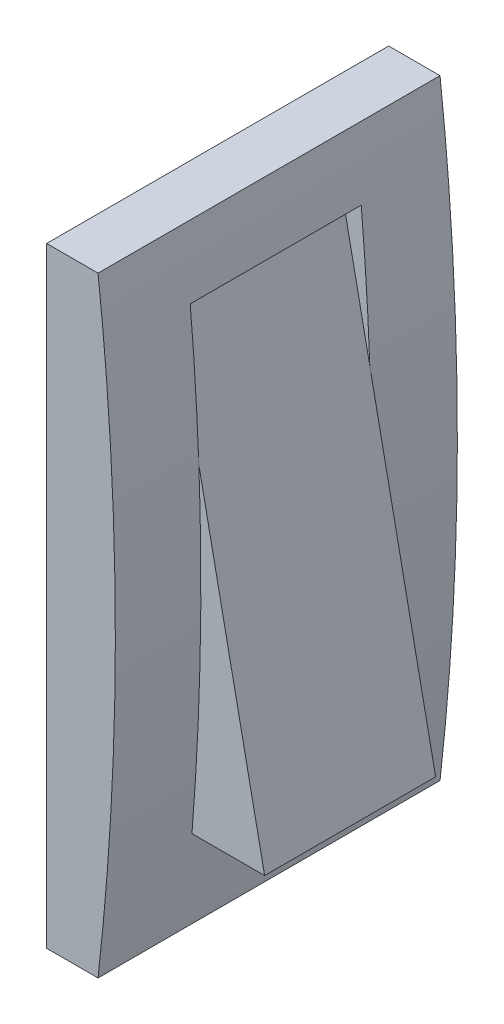
ISO-10303-21;
HEADER;
FILE_DESCRIPTION(('STEP AP214'),'2;1');
FILE_NAME('part.step','',(''),(''),'','','');
FILE_SCHEMA(('AUTOMOTIVE_DESIGN { 1 0 10303 214 1 1 1 1 }'));
ENDSEC;
DATA;
#1=APPLICATION_CONTEXT('core data for automotive mechanical design processes');
#2=APPLICATION_PROTOCOL_DEFINITION('international standard','automotive_design',2000,#1);
#3=PRODUCT_CONTEXT('',#1,'mechanical');
#4=PRODUCT('Part','Part','',(#3));
#5=PRODUCT_RELATED_PRODUCT_CATEGORY('part','',(#4));
#6=PRODUCT_DEFINITION_FORMATION('','',#4);
#7=PRODUCT_DEFINITION_CONTEXT('part definition',#1,'design');
#8=PRODUCT_DEFINITION('design','',#6,#7);
#9=PRODUCT_DEFINITION_SHAPE('','',#8);
#10=(LENGTH_UNIT() NAMED_UNIT(*) SI_UNIT(.MILLI.,.METRE.));
#11=(NAMED_UNIT(*) PLANE_ANGLE_UNIT() SI_UNIT($,.RADIAN.));
#12=(NAMED_UNIT(*) SI_UNIT($,.STERADIAN.) SOLID_ANGLE_UNIT());
#13=UNCERTAINTY_MEASURE_WITH_UNIT(LENGTH_MEASURE(1.E-05),#10,'distance_accuracy_value','');
#14=(GEOMETRIC_REPRESENTATION_CONTEXT(3) GLOBAL_UNCERTAINTY_ASSIGNED_CONTEXT((#13)) GLOBAL_UNIT_ASSIGNED_CONTEXT((#10,
#11,#12)) REPRESENTATION_CONTEXT('',''));
#15=CARTESIAN_POINT('',(0.,0.,0.));
#16=DIRECTION('',(0.,0.,1.));
#17=DIRECTION('',(1.,0.,0.));
#18=AXIS2_PLACEMENT_3D('',#15,#16,#17);
#19=CARTESIAN_POINT('',(0.,-35.6974549437155,-20.));
#20=DIRECTION('',(0.,-1.,0.));
#21=DIRECTION('',(0.,0.,-1.));
#22=AXIS2_PLACEMENT_3D('',#19,#20,#21);
#23=PLANE('',#22);
#24=DIRECTION('',(0.,0.,1.));
#25=VECTOR('',#24,1.);
#26=CARTESIAN_POINT('',(6.00944832763967,-35.6974549437155,-20.));
#27=LINE('',#26,#25);
#28=CARTESIAN_POINT('',(6.00944832763967,-35.6974549437155,-20.));
#29=VERTEX_POINT('',#28);
#30=CARTESIAN_POINT('',(6.00944832763967,-35.6974549437155,20.));
#31=VERTEX_POINT('',#30);
#32=EDGE_CURVE('E212',#29,#31,#27,.T.);
#33=ORIENTED_EDGE('',*,*,#32,.T.);
#34=DIRECTION('',(1.,0.,0.));
#35=VECTOR('',#34,1.);
#36=CARTESIAN_POINT('',(0.,-35.6974549437155,20.));
#37=LINE('',#36,#35);
#38=CARTESIAN_POINT('',(0.,-35.6974549437155,20.));
#39=VERTEX_POINT('',#38);
#40=EDGE_CURVE('E135',#39,#31,#37,.T.);
#41=ORIENTED_EDGE('',*,*,#40,.F.);
#42=DIRECTION('',(0.,0.,1.));
#43=VECTOR('',#42,1.);
#44=CARTESIAN_POINT('',(0.,-35.6974549437155,-20.));
#45=LINE('',#44,#43);
#46=CARTESIAN_POINT('',(0.,-35.6974549437155,-20.));
#47=VERTEX_POINT('',#46);
#48=EDGE_CURVE('E225',#47,#39,#45,.T.);
#49=ORIENTED_EDGE('',*,*,#48,.F.);
#50=DIRECTION('',(1.,0.,0.));
#51=VECTOR('',#50,1.);
#52=CARTESIAN_POINT('',(0.,-35.6974549437155,-20.));
#53=LINE('',#52,#51);
#54=EDGE_CURVE('E152',#47,#29,#53,.T.);
#55=ORIENTED_EDGE('',*,*,#54,.T.);
#56=EDGE_LOOP('',(#33,#41,#49,#55));
#57=FACE_BOUND('',#56,.T.);
#58=ADVANCED_FACE('F32',(#57),#23,.T.);
#59=CARTESIAN_POINT('',(0.,-35.6974549437155,-20.));
#60=DIRECTION('',(-1.,0.,0.));
#61=DIRECTION('',(0.,0.,1.));
#62=AXIS2_PLACEMENT_3D('',#59,#60,#61);
#63=PLANE('',#62);
#64=ORIENTED_EDGE('',*,*,#48,.T.);
#65=DIRECTION('',(0.,-1.,0.));
#66=VECTOR('',#65,1.);
#67=CARTESIAN_POINT('',(0.,-35.6974549437155,20.));
#68=LINE('',#67,#66);
#69=CARTESIAN_POINT('',(0.,35.6974549437155,20.));
#70=VERTEX_POINT('',#69);
#71=EDGE_CURVE('E149',#70,#39,#68,.T.);
#72=ORIENTED_EDGE('',*,*,#71,.F.);
#73=DIRECTION('',(0.,0.,1.));
#74=VECTOR('',#73,1.);
#75=CARTESIAN_POINT('',(0.,35.6974549437155,-20.));
#76=LINE('',#75,#74);
#77=CARTESIAN_POINT('',(0.,35.6974549437155,-20.));
#78=VERTEX_POINT('',#77);
#79=EDGE_CURVE('E223',#78,#70,#76,.T.);
#80=ORIENTED_EDGE('',*,*,#79,.F.);
#81=DIRECTION('',(0.,-1.,0.));
#82=VECTOR('',#81,1.);
#83=CARTESIAN_POINT('',(0.,-35.6974549437155,-20.));
#84=LINE('',#83,#82);
#85=EDGE_CURVE('E218',#78,#47,#84,.T.);
#86=ORIENTED_EDGE('',*,*,#85,.T.);
#87=EDGE_LOOP('',(#64,#72,#80,#86));
#88=FACE_BOUND('',#87,.T.);
#89=ADVANCED_FACE('F173',(#88),#63,.T.);
#90=CARTESIAN_POINT('',(0.,35.6974549437155,-20.));
#91=DIRECTION('',(0.,1.,0.));
#92=DIRECTION('',(0.,0.,1.));
#93=AXIS2_PLACEMENT_3D('',#90,#91,#92);
#94=PLANE('',#93);
#95=ORIENTED_EDGE('',*,*,#79,.T.);
#96=DIRECTION('',(-1.,0.,0.));
#97=VECTOR('',#96,1.);
#98=CARTESIAN_POINT('',(0.,35.6974549437155,20.));
#99=LINE('',#98,#97);
#100=CARTESIAN_POINT('',(6.00944832763967,35.6974549437155,20.));
#101=VERTEX_POINT('',#100);
#102=EDGE_CURVE('E143',#101,#70,#99,.T.);
#103=ORIENTED_EDGE('',*,*,#102,.F.);
#104=DIRECTION('',(0.,0.,1.));
#105=VECTOR('',#104,1.);
#106=CARTESIAN_POINT('',(6.00944832763967,35.6974549437155,-20.));
#107=LINE('',#106,#105);
#108=CARTESIAN_POINT('',(6.00944832763967,35.6974549437155,-20.));
#109=VERTEX_POINT('',#108);
#110=EDGE_CURVE('E217',#109,#101,#107,.T.);
#111=ORIENTED_EDGE('',*,*,#110,.F.);
#112=DIRECTION('',(-1.,0.,0.));
#113=VECTOR('',#112,1.);
#114=CARTESIAN_POINT('',(0.,35.6974549437155,-20.));
#115=LINE('',#114,#113);
#116=EDGE_CURVE('E161',#109,#78,#115,.T.);
#117=ORIENTED_EDGE('',*,*,#116,.T.);
#118=EDGE_LOOP('',(#95,#103,#111,#117));
#119=FACE_BOUND('',#118,.T.);
#120=ADVANCED_FACE('F170',(#119),#94,.T.);
#121=CARTESIAN_POINT('',(6.00944832763967,-35.6974549437155,-20.));
#122=CARTESIAN_POINT('',(10.0568252809878,0.,-20.));
#123=CARTESIAN_POINT('',(6.00944832763967,35.6974549437155,-20.));
#124=B_SPLINE_CURVE_WITH_KNOTS('',2,(#121,#122,#123),.UNSPECIFIED.,.F.,.F.,(3,3),(0.,1.),.UNSPECIFIED.);
#125=DIRECTION('',(0.,0.,1.));
#126=VECTOR('',#125,1.);
#127=SURFACE_OF_LINEAR_EXTRUSION('',#124,#126);
#128=CARTESIAN_POINT('',(6.00944832763967,-35.6974549437155,10.));
#129=CARTESIAN_POINT('',(10.0568252809878,0.,10.));
#130=CARTESIAN_POINT('',(6.00944832763967,35.6974549437155,10.));
#131=B_SPLINE_CURVE_WITH_KNOTS('',2,(#128,#129,#130),.UNSPECIFIED.,.F.,.F.,(3,3),(0.,1.),.UNSPECIFIED.);
#132=CARTESIAN_POINT('',(6.79041804826102,27.9738248469303,10.));
#133=VERTEX_POINT('',#132);
#134=CARTESIAN_POINT('',(7.7977783266696,12.1739173200582,10.));
#135=VERTEX_POINT('',#134);
#136=EDGE_CURVE('E39',#133,#135,#131,.F.);
#137=ORIENTED_EDGE('',*,*,#136,.F.);
#138=DIRECTION('',(0.,0.,1.));
#139=VECTOR('',#138,1.);
#140=CARTESIAN_POINT('',(6.79041804826102,27.9738248469303,-20.));
#141=LINE('',#140,#139);
#142=CARTESIAN_POINT('',(6.79041804826102,27.9738248469303,-10.));
#143=VERTEX_POINT('',#142);
#144=EDGE_CURVE('E236',#133,#143,#141,.F.);
#145=ORIENTED_EDGE('',*,*,#144,.T.);
#146=CARTESIAN_POINT('',(6.00944832763967,-35.6974549437155,-10.));
#147=CARTESIAN_POINT('',(10.0568252809878,0.,-10.));
#148=CARTESIAN_POINT('',(6.00944832763967,35.6974549437155,-10.));
#149=B_SPLINE_CURVE_WITH_KNOTS('',2,(#146,#147,#148),.UNSPECIFIED.,.F.,.F.,(3,3),(0.,1.),.UNSPECIFIED.);
#150=CARTESIAN_POINT('',(7.7977783266696,12.1739173200582,-10.));
#151=VERTEX_POINT('',#150);
#152=EDGE_CURVE('E229',#143,#151,#149,.F.);
#153=ORIENTED_EDGE('',*,*,#152,.T.);
#154=CARTESIAN_POINT('',(6.99404061087857,-25.5795736572412,-10.));
#155=VERTEX_POINT('',#154);
#156=EDGE_CURVE('E227',#151,#155,#149,.F.);
#157=ORIENTED_EDGE('',*,*,#156,.T.);
#158=DIRECTION('',(0.,0.,1.));
#159=VECTOR('',#158,1.);
#160=CARTESIAN_POINT('',(6.99404061087857,-25.5795736572412,-20.));
#161=LINE('',#160,#159);
#162=CARTESIAN_POINT('',(6.99404061087857,-25.5795736572412,10.));
#163=VERTEX_POINT('',#162);
#164=EDGE_CURVE('E242',#155,#163,#161,.T.);
#165=ORIENTED_EDGE('',*,*,#164,.T.);
#166=EDGE_CURVE('E46',#135,#163,#131,.F.);
#167=ORIENTED_EDGE('',*,*,#166,.F.);
#168=EDGE_LOOP('',(#137,#145,#153,#157,#165,#167));
#169=FACE_BOUND('',#168,.T.);
#170=ORIENTED_EDGE('',*,*,#110,.T.);
#171=CARTESIAN_POINT('',(6.00944832763967,-35.6974549437155,20.));
#172=CARTESIAN_POINT('',(10.0568252809878,0.,20.));
#173=CARTESIAN_POINT('',(6.00944832763967,35.6974549437155,20.));
#174=B_SPLINE_CURVE_WITH_KNOTS('',2,(#171,#172,#173),.UNSPECIFIED.,.F.,.F.,(3,3),(0.,1.),.UNSPECIFIED.);
#175=EDGE_CURVE('E138',#31,#101,#174,.T.);
#176=ORIENTED_EDGE('',*,*,#175,.F.);
#177=ORIENTED_EDGE('',*,*,#32,.F.);
#178=EDGE_CURVE('E155',#29,#109,#124,.T.);
#179=ORIENTED_EDGE('',*,*,#178,.T.);
#180=EDGE_LOOP('',(#170,#176,#177,#179));
#181=FACE_BOUND('',#180,.T.);
#182=ADVANCED_FACE('F166',(#169,#181),#127,.T.);
#183=CARTESIAN_POINT('',(8.03313680431375,0.,-20.));
#184=DIRECTION('',(0.,0.,1.));
#185=DIRECTION('',(1.,0.,0.));
#186=AXIS2_PLACEMENT_3D('',#183,#184,#185);
#187=PLANE('',#186);
#188=ORIENTED_EDGE('',*,*,#54,.F.);
#189=ORIENTED_EDGE('',*,*,#85,.F.);
#190=ORIENTED_EDGE('',*,*,#116,.F.);
#191=ORIENTED_EDGE('',*,*,#178,.F.);
#192=EDGE_LOOP('',(#188,#189,#190,#191));
#193=FACE_BOUND('',#192,.T.);
#194=ADVANCED_FACE('F169',(#193),#187,.F.);
#195=CARTESIAN_POINT('',(8.03313680431375,0.,20.));
#196=DIRECTION('',(0.,0.,1.));
#197=DIRECTION('',(1.,0.,0.));
#198=AXIS2_PLACEMENT_3D('',#195,#196,#197);
#199=PLANE('',#198);
#200=ORIENTED_EDGE('',*,*,#40,.T.);
#201=ORIENTED_EDGE('',*,*,#175,.T.);
#202=ORIENTED_EDGE('',*,*,#102,.T.);
#203=ORIENTED_EDGE('',*,*,#71,.T.);
#204=EDGE_LOOP('',(#200,#201,#202,#203));
#205=FACE_BOUND('',#204,.T.);
#206=ADVANCED_FACE('F180',(#205),#199,.T.);
#207=CARTESIAN_POINT('',(4.57828676522881,27.9738248469303,10.));
#208=DIRECTION('',(0.,-1.,0.));
#209=DIRECTION('',(0.,0.,-1.));
#210=AXIS2_PLACEMENT_3D('',#207,#208,#209);
#211=PLANE('',#210);
#212=DIRECTION('',(-1.,0.,0.));
#213=VECTOR('',#212,1.);
#214=CARTESIAN_POINT('',(4.57828676522881,27.9738248469303,10.));
#215=LINE('',#214,#213);
#216=CARTESIAN_POINT('',(4.57828676522881,27.9738248469303,10.));
#217=VERTEX_POINT('',#216);
#218=EDGE_CURVE('E130',#133,#217,#215,.T.);
#219=ORIENTED_EDGE('',*,*,#218,.T.);
#220=DIRECTION('',(0.,0.,-1.));
#221=VECTOR('',#220,1.);
#222=CARTESIAN_POINT('',(4.57828676522881,27.9738248469303,10.));
#223=LINE('',#222,#221);
#224=CARTESIAN_POINT('',(4.57828676522881,27.9738248469303,-10.));
#225=VERTEX_POINT('',#224);
#226=EDGE_CURVE('E133',#217,#225,#223,.T.);
#227=ORIENTED_EDGE('',*,*,#226,.T.);
#228=DIRECTION('',(-1.,0.,0.));
#229=VECTOR('',#228,1.);
#230=CARTESIAN_POINT('',(4.57828676522881,27.9738248469303,-10.));
#231=LINE('',#230,#229);
#232=EDGE_CURVE('E119',#143,#225,#231,.T.);
#233=ORIENTED_EDGE('',*,*,#232,.F.);
#234=ORIENTED_EDGE('',*,*,#144,.F.);
#235=EDGE_LOOP('',(#219,#227,#233,#234));
#236=FACE_BOUND('',#235,.T.);
#237=ADVANCED_FACE('F184',(#236),#211,.T.);
#238=CARTESIAN_POINT('',(0.,0.,10.));
#239=DIRECTION('',(0.,0.,1.));
#240=DIRECTION('',(1.,0.,0.));
#241=AXIS2_PLACEMENT_3D('',#238,#239,#240);
#242=PLANE('',#241);
#243=ORIENTED_EDGE('',*,*,#136,.T.);
#244=DIRECTION('',(-0.199663544489269,0.979864515635698,0.));
#245=VECTOR('',#244,1.);
#246=CARTESIAN_POINT('',(15.4906743393948,-25.5795736572412,10.));
#247=LINE('',#246,#245);
#248=EDGE_CURVE('E124',#135,#217,#247,.T.);
#249=ORIENTED_EDGE('',*,*,#248,.T.);
#250=ORIENTED_EDGE('',*,*,#218,.F.);
#251=EDGE_LOOP('',(#243,#249,#250));
#252=FACE_BOUND('',#251,.T.);
#253=ADVANCED_FACE('F188',(#252),#242,.F.);
#254=CARTESIAN_POINT('',(0.,0.,-10.));
#255=DIRECTION('',(0.,0.,1.));
#256=DIRECTION('',(1.,0.,0.));
#257=AXIS2_PLACEMENT_3D('',#254,#255,#256);
#258=PLANE('',#257);
#259=DIRECTION('',(-0.199663544489269,0.979864515635698,0.));
#260=VECTOR('',#259,1.);
#261=CARTESIAN_POINT('',(9.86866016569109,2.01090215698199,-10.));
#262=LINE('',#261,#260);
#263=EDGE_CURVE('E11',#151,#225,#262,.T.);
#264=ORIENTED_EDGE('',*,*,#263,.F.);
#265=ORIENTED_EDGE('',*,*,#152,.F.);
#266=ORIENTED_EDGE('',*,*,#232,.T.);
#267=EDGE_LOOP('',(#264,#265,#266));
#268=FACE_BOUND('',#267,.T.);
#269=ADVANCED_FACE('F192',(#268),#258,.T.);
#270=CARTESIAN_POINT('',(15.4906743393948,-25.5795736572412,-10.));
#271=DIRECTION('',(0.979864515635698,0.199663544489269,0.));
#272=DIRECTION('',(-0.199663544489269,0.979864515635698,0.));
#273=AXIS2_PLACEMENT_3D('',#270,#271,#272);
#274=PLANE('',#273);
#275=ORIENTED_EDGE('',*,*,#226,.F.);
#276=ORIENTED_EDGE('',*,*,#248,.F.);
#277=CARTESIAN_POINT('',(15.4906743393948,-25.5795736572412,10.));
#278=VERTEX_POINT('',#277);
#279=EDGE_CURVE('E106',#278,#135,#247,.T.);
#280=ORIENTED_EDGE('',*,*,#279,.F.);
#281=DIRECTION('',(0.,0.,1.));
#282=VECTOR('',#281,1.);
#283=CARTESIAN_POINT('',(15.4906743393948,-25.5795736572412,-10.));
#284=LINE('',#283,#282);
#285=CARTESIAN_POINT('',(15.4906743393948,-25.5795736572412,-10.));
#286=VERTEX_POINT('',#285);
#287=EDGE_CURVE('E112',#286,#278,#284,.T.);
#288=ORIENTED_EDGE('',*,*,#287,.F.);
#289=DIRECTION('',(-0.199663544489269,0.979864515635698,0.));
#290=VECTOR('',#289,1.);
#291=CARTESIAN_POINT('',(15.4906743393948,-25.5795736572412,-10.));
#292=LINE('',#291,#290);
#293=EDGE_CURVE('E109',#286,#151,#292,.T.);
#294=ORIENTED_EDGE('',*,*,#293,.T.);
#295=ORIENTED_EDGE('',*,*,#263,.T.);
#296=EDGE_LOOP('',(#275,#276,#280,#288,#294,#295));
#297=FACE_BOUND('',#296,.T.);
#298=ADVANCED_FACE('F123',(#297),#274,.T.);
#299=CARTESIAN_POINT('',(4.57828676522881,-25.5795736572412,-10.));
#300=DIRECTION('',(0.,-1.,0.));
#301=DIRECTION('',(0.,0.,-1.));
#302=AXIS2_PLACEMENT_3D('',#299,#300,#301);
#303=PLANE('',#302);
#304=DIRECTION('',(1.,0.,0.));
#305=VECTOR('',#304,1.);
#306=CARTESIAN_POINT('',(4.57828676522881,-25.5795736572412,10.));
#307=LINE('',#306,#305);
#308=EDGE_CURVE('E102',#163,#278,#307,.T.);
#309=ORIENTED_EDGE('',*,*,#308,.F.);
#310=ORIENTED_EDGE('',*,*,#164,.F.);
#311=DIRECTION('',(1.,0.,0.));
#312=VECTOR('',#311,1.);
#313=CARTESIAN_POINT('',(4.57828676522881,-25.5795736572412,-10.));
#314=LINE('',#313,#312);
#315=EDGE_CURVE('E115',#155,#286,#314,.T.);
#316=ORIENTED_EDGE('',*,*,#315,.T.);
#317=ORIENTED_EDGE('',*,*,#287,.T.);
#318=EDGE_LOOP('',(#309,#310,#316,#317));
#319=FACE_BOUND('',#318,.T.);
#320=ADVANCED_FACE('F113',(#319),#303,.T.);
#321=CARTESIAN_POINT('',(0.,0.,-10.));
#322=DIRECTION('',(0.,0.,-1.));
#323=DIRECTION('',(-1.,0.,0.));
#324=AXIS2_PLACEMENT_3D('',#321,#322,#323);
#325=PLANE('',#324);
#326=ORIENTED_EDGE('',*,*,#315,.F.);
#327=ORIENTED_EDGE('',*,*,#156,.F.);
#328=ORIENTED_EDGE('',*,*,#293,.F.);
#329=EDGE_LOOP('',(#326,#327,#328));
#330=FACE_BOUND('',#329,.T.);
#331=ADVANCED_FACE('F200',(#330),#325,.T.);
#332=CARTESIAN_POINT('',(0.,0.,10.));
#333=DIRECTION('',(0.,0.,-1.));
#334=DIRECTION('',(-1.,0.,0.));
#335=AXIS2_PLACEMENT_3D('',#332,#333,#334);
#336=PLANE('',#335);
#337=ORIENTED_EDGE('',*,*,#166,.T.);
#338=ORIENTED_EDGE('',*,*,#308,.T.);
#339=ORIENTED_EDGE('',*,*,#279,.T.);
#340=EDGE_LOOP('',(#337,#338,#339));
#341=FACE_BOUND('',#340,.T.);
#342=ADVANCED_FACE('F104',(#341),#336,.F.);
#343=CLOSED_SHELL('',(#58,#89,#120,#182,#194,#206,#237,#253,#269,#298,#320,#331,#342));
#344=MANIFOLD_SOLID_BREP('B2',#343);
#345=ADVANCED_BREP_SHAPE_REPRESENTATION('',(#18,#344),#14);
#346=SHAPE_DEFINITION_REPRESENTATION(#9,#345);
ENDSEC;
END-ISO-10303-21;
